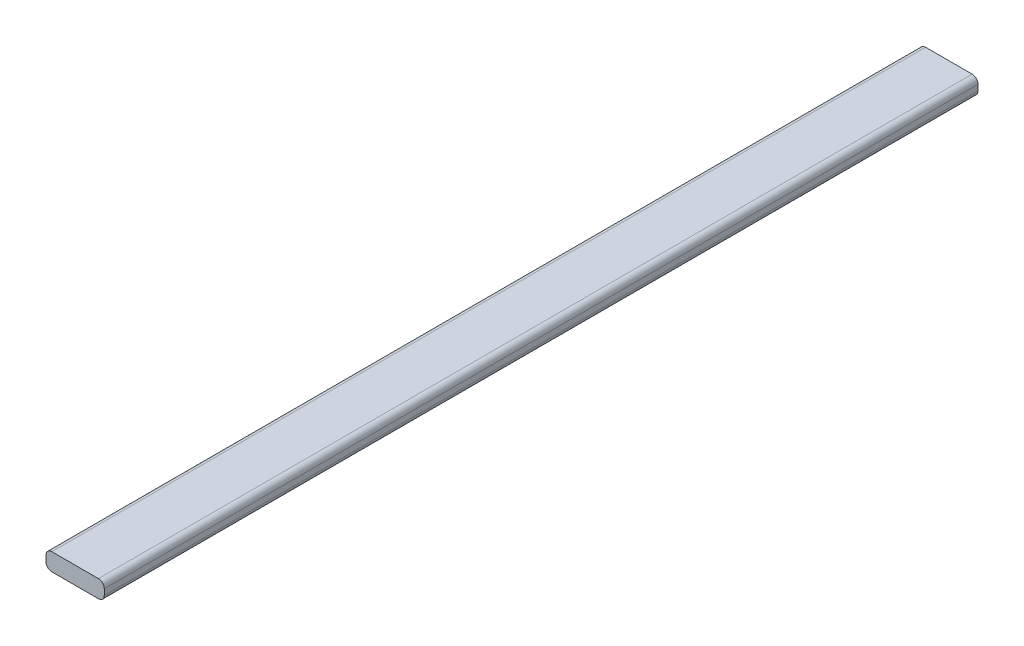
ISO-10303-21;
HEADER;
FILE_DESCRIPTION(('STEP AP214'),'2;1');
FILE_NAME('part.step','',(''),(''),'','','');
FILE_SCHEMA(('AUTOMOTIVE_DESIGN { 1 0 10303 214 1 1 1 1 }'));
ENDSEC;
DATA;
#1=APPLICATION_CONTEXT('core data for automotive mechanical design processes');
#2=APPLICATION_PROTOCOL_DEFINITION('international standard','automotive_design',2000,#1);
#3=PRODUCT_CONTEXT('',#1,'mechanical');
#4=PRODUCT('Part','Part','',(#3));
#5=PRODUCT_RELATED_PRODUCT_CATEGORY('part','',(#4));
#6=PRODUCT_DEFINITION_FORMATION('','',#4);
#7=PRODUCT_DEFINITION_CONTEXT('part definition',#1,'design');
#8=PRODUCT_DEFINITION('design','',#6,#7);
#9=PRODUCT_DEFINITION_SHAPE('','',#8);
#10=(LENGTH_UNIT() NAMED_UNIT(*) SI_UNIT(.MILLI.,.METRE.));
#11=(NAMED_UNIT(*) PLANE_ANGLE_UNIT() SI_UNIT($,.RADIAN.));
#12=(NAMED_UNIT(*) SI_UNIT($,.STERADIAN.) SOLID_ANGLE_UNIT());
#13=UNCERTAINTY_MEASURE_WITH_UNIT(LENGTH_MEASURE(1.E-05),#10,'distance_accuracy_value','');
#14=(GEOMETRIC_REPRESENTATION_CONTEXT(3) GLOBAL_UNCERTAINTY_ASSIGNED_CONTEXT((#13)) GLOBAL_UNIT_ASSIGNED_CONTEXT((#10,
#11,#12)) REPRESENTATION_CONTEXT('',''));
#15=CARTESIAN_POINT('',(0.,0.,0.));
#16=DIRECTION('',(0.,0.,1.));
#17=DIRECTION('',(1.,0.,0.));
#18=AXIS2_PLACEMENT_3D('',#15,#16,#17);
#19=CARTESIAN_POINT('',(4.,0.5,150.));
#20=DIRECTION('',(0.,0.,-1.));
#21=DIRECTION('',(-1.,0.,0.));
#22=AXIS2_PLACEMENT_3D('',#19,#20,#21);
#23=CYLINDRICAL_SURFACE('',#22,1.);
#24=CARTESIAN_POINT('',(4.,0.5,0.));
#25=DIRECTION('',(0.,0.,1.));
#26=DIRECTION('',(-1.,0.,0.));
#27=AXIS2_PLACEMENT_3D('',#24,#25,#26);
#28=CIRCLE('',#27,1.);
#29=CARTESIAN_POINT('',(5.,0.5,0.));
#30=VERTEX_POINT('',#29);
#31=CARTESIAN_POINT('',(4.,1.5,0.));
#32=VERTEX_POINT('',#31);
#33=EDGE_CURVE('E129',#30,#32,#28,.T.);
#34=ORIENTED_EDGE('',*,*,#33,.T.);
#35=DIRECTION('',(0.,0.,-1.));
#36=VECTOR('',#35,1.);
#37=CARTESIAN_POINT('',(4.,1.5,150.));
#38=LINE('',#37,#36);
#39=CARTESIAN_POINT('',(4.,1.5,150.));
#40=VERTEX_POINT('',#39);
#41=EDGE_CURVE('E11',#40,#32,#38,.T.);
#42=ORIENTED_EDGE('',*,*,#41,.F.);
#43=CARTESIAN_POINT('',(4.,0.5,150.));
#44=DIRECTION('',(0.,0.,1.));
#45=DIRECTION('',(-1.,0.,0.));
#46=AXIS2_PLACEMENT_3D('',#43,#44,#45);
#47=CIRCLE('',#46,1.);
#48=CARTESIAN_POINT('',(5.,0.5,150.));
#49=VERTEX_POINT('',#48);
#50=EDGE_CURVE('E143',#49,#40,#47,.T.);
#51=ORIENTED_EDGE('',*,*,#50,.F.);
#52=DIRECTION('',(0.,0.,-1.));
#53=VECTOR('',#52,1.);
#54=CARTESIAN_POINT('',(5.,0.5,150.));
#55=LINE('',#54,#53);
#56=EDGE_CURVE('E125',#49,#30,#55,.T.);
#57=ORIENTED_EDGE('',*,*,#56,.T.);
#58=EDGE_LOOP('',(#34,#42,#51,#57));
#59=FACE_BOUND('',#58,.T.);
#60=ADVANCED_FACE('F33',(#59),#23,.T.);
#61=CARTESIAN_POINT('',(-4.,1.5,150.));
#62=DIRECTION('',(0.,-1.,0.));
#63=DIRECTION('',(0.,0.,-1.));
#64=AXIS2_PLACEMENT_3D('',#61,#62,#63);
#65=PLANE('',#64);
#66=DIRECTION('',(-1.,0.,0.));
#67=VECTOR('',#66,1.);
#68=CARTESIAN_POINT('',(-4.,1.5,0.));
#69=LINE('',#68,#67);
#70=CARTESIAN_POINT('',(-4.,1.5,0.));
#71=VERTEX_POINT('',#70);
#72=EDGE_CURVE('E132',#32,#71,#69,.T.);
#73=ORIENTED_EDGE('',*,*,#72,.T.);
#74=DIRECTION('',(0.,0.,-1.));
#75=VECTOR('',#74,1.);
#76=CARTESIAN_POINT('',(-4.,1.5,150.));
#77=LINE('',#76,#75);
#78=CARTESIAN_POINT('',(-4.,1.5,150.));
#79=VERTEX_POINT('',#78);
#80=EDGE_CURVE('E41',#79,#71,#77,.T.);
#81=ORIENTED_EDGE('',*,*,#80,.F.);
#82=DIRECTION('',(-1.,0.,0.));
#83=VECTOR('',#82,1.);
#84=CARTESIAN_POINT('',(-4.,1.5,150.));
#85=LINE('',#84,#83);
#86=EDGE_CURVE('E92',#40,#79,#85,.T.);
#87=ORIENTED_EDGE('',*,*,#86,.F.);
#88=ORIENTED_EDGE('',*,*,#41,.T.);
#89=EDGE_LOOP('',(#73,#81,#87,#88));
#90=FACE_BOUND('',#89,.T.);
#91=ADVANCED_FACE('F178',(#90),#65,.F.);
#92=CARTESIAN_POINT('',(-4.,0.5,150.));
#93=DIRECTION('',(0.,0.,-1.));
#94=DIRECTION('',(-1.,0.,0.));
#95=AXIS2_PLACEMENT_3D('',#92,#93,#94);
#96=CYLINDRICAL_SURFACE('',#95,1.);
#97=CARTESIAN_POINT('',(-4.,0.5,0.));
#98=DIRECTION('',(0.,0.,1.));
#99=DIRECTION('',(1.,0.,0.));
#100=AXIS2_PLACEMENT_3D('',#97,#98,#99);
#101=CIRCLE('',#100,1.);
#102=CARTESIAN_POINT('',(-5.,0.5,0.));
#103=VERTEX_POINT('',#102);
#104=EDGE_CURVE('E134',#71,#103,#101,.T.);
#105=ORIENTED_EDGE('',*,*,#104,.T.);
#106=DIRECTION('',(0.,0.,-1.));
#107=VECTOR('',#106,1.);
#108=CARTESIAN_POINT('',(-5.,0.5,150.));
#109=LINE('',#108,#107);
#110=CARTESIAN_POINT('',(-5.,0.5,150.));
#111=VERTEX_POINT('',#110);
#112=EDGE_CURVE('E150',#111,#103,#109,.T.);
#113=ORIENTED_EDGE('',*,*,#112,.F.);
#114=CARTESIAN_POINT('',(-4.,0.5,150.));
#115=DIRECTION('',(0.,0.,1.));
#116=DIRECTION('',(1.,0.,0.));
#117=AXIS2_PLACEMENT_3D('',#114,#115,#116);
#118=CIRCLE('',#117,1.);
#119=EDGE_CURVE('E158',#79,#111,#118,.T.);
#120=ORIENTED_EDGE('',*,*,#119,.F.);
#121=ORIENTED_EDGE('',*,*,#80,.T.);
#122=EDGE_LOOP('',(#105,#113,#120,#121));
#123=FACE_BOUND('',#122,.T.);
#124=ADVANCED_FACE('F156',(#123),#96,.T.);
#125=CARTESIAN_POINT('',(-5.,0.5,150.));
#126=DIRECTION('',(1.,0.,0.));
#127=DIRECTION('',(0.,0.,-1.));
#128=AXIS2_PLACEMENT_3D('',#125,#126,#127);
#129=PLANE('',#128);
#130=DIRECTION('',(0.,-1.,0.));
#131=VECTOR('',#130,1.);
#132=CARTESIAN_POINT('',(-5.,0.5,0.));
#133=LINE('',#132,#131);
#134=CARTESIAN_POINT('',(-5.,-0.5,0.));
#135=VERTEX_POINT('',#134);
#136=EDGE_CURVE('E136',#103,#135,#133,.T.);
#137=ORIENTED_EDGE('',*,*,#136,.T.);
#138=DIRECTION('',(0.,0.,-1.));
#139=VECTOR('',#138,1.);
#140=CARTESIAN_POINT('',(-5.,-0.5,150.));
#141=LINE('',#140,#139);
#142=CARTESIAN_POINT('',(-5.,-0.5,150.));
#143=VERTEX_POINT('',#142);
#144=EDGE_CURVE('E147',#143,#135,#141,.T.);
#145=ORIENTED_EDGE('',*,*,#144,.F.);
#146=DIRECTION('',(0.,-1.,0.));
#147=VECTOR('',#146,1.);
#148=CARTESIAN_POINT('',(-5.,0.5,150.));
#149=LINE('',#148,#147);
#150=EDGE_CURVE('E170',#111,#143,#149,.T.);
#151=ORIENTED_EDGE('',*,*,#150,.F.);
#152=ORIENTED_EDGE('',*,*,#112,.T.);
#153=EDGE_LOOP('',(#137,#145,#151,#152));
#154=FACE_BOUND('',#153,.T.);
#155=ADVANCED_FACE('F166',(#154),#129,.F.);
#156=CARTESIAN_POINT('',(-4.,-0.5,150.));
#157=DIRECTION('',(0.,0.,-1.));
#158=DIRECTION('',(-1.,0.,0.));
#159=AXIS2_PLACEMENT_3D('',#156,#157,#158);
#160=CYLINDRICAL_SURFACE('',#159,1.);
#161=CARTESIAN_POINT('',(-4.,-0.5,0.));
#162=DIRECTION('',(0.,0.,1.));
#163=DIRECTION('',(1.,0.,0.));
#164=AXIS2_PLACEMENT_3D('',#161,#162,#163);
#165=CIRCLE('',#164,1.);
#166=CARTESIAN_POINT('',(-4.,-1.5,0.));
#167=VERTEX_POINT('',#166);
#168=EDGE_CURVE('E138',#135,#167,#165,.T.);
#169=ORIENTED_EDGE('',*,*,#168,.T.);
#170=DIRECTION('',(0.,0.,-1.));
#171=VECTOR('',#170,1.);
#172=CARTESIAN_POINT('',(-4.,-1.5,150.));
#173=LINE('',#172,#171);
#174=CARTESIAN_POINT('',(-4.,-1.5,150.));
#175=VERTEX_POINT('',#174);
#176=EDGE_CURVE('E120',#175,#167,#173,.T.);
#177=ORIENTED_EDGE('',*,*,#176,.F.);
#178=CARTESIAN_POINT('',(-4.,-0.5,150.));
#179=DIRECTION('',(0.,0.,1.));
#180=DIRECTION('',(1.,0.,0.));
#181=AXIS2_PLACEMENT_3D('',#178,#179,#180);
#182=CIRCLE('',#181,1.);
#183=EDGE_CURVE('E111',#143,#175,#182,.T.);
#184=ORIENTED_EDGE('',*,*,#183,.F.);
#185=ORIENTED_EDGE('',*,*,#144,.T.);
#186=EDGE_LOOP('',(#169,#177,#184,#185));
#187=FACE_BOUND('',#186,.T.);
#188=ADVANCED_FACE('F169',(#187),#160,.T.);
#189=CARTESIAN_POINT('',(-4.,-1.5,150.));
#190=DIRECTION('',(0.,1.,0.));
#191=DIRECTION('',(0.,0.,1.));
#192=AXIS2_PLACEMENT_3D('',#189,#190,#191);
#193=PLANE('',#192);
#194=DIRECTION('',(1.,0.,0.));
#195=VECTOR('',#194,1.);
#196=CARTESIAN_POINT('',(-4.,-1.5,0.));
#197=LINE('',#196,#195);
#198=CARTESIAN_POINT('',(4.,-1.5,0.));
#199=VERTEX_POINT('',#198);
#200=EDGE_CURVE('E119',#167,#199,#197,.T.);
#201=ORIENTED_EDGE('',*,*,#200,.T.);
#202=DIRECTION('',(0.,0.,-1.));
#203=VECTOR('',#202,1.);
#204=CARTESIAN_POINT('',(4.,-1.5,150.));
#205=LINE('',#204,#203);
#206=CARTESIAN_POINT('',(4.,-1.5,150.));
#207=VERTEX_POINT('',#206);
#208=EDGE_CURVE('E116',#207,#199,#205,.T.);
#209=ORIENTED_EDGE('',*,*,#208,.F.);
#210=DIRECTION('',(1.,0.,0.));
#211=VECTOR('',#210,1.);
#212=CARTESIAN_POINT('',(-4.,-1.5,150.));
#213=LINE('',#212,#211);
#214=EDGE_CURVE('E105',#175,#207,#213,.T.);
#215=ORIENTED_EDGE('',*,*,#214,.F.);
#216=ORIENTED_EDGE('',*,*,#176,.T.);
#217=EDGE_LOOP('',(#201,#209,#215,#216));
#218=FACE_BOUND('',#217,.T.);
#219=ADVANCED_FACE('F117',(#218),#193,.F.);
#220=CARTESIAN_POINT('',(4.,-0.5,150.));
#221=DIRECTION('',(0.,0.,-1.));
#222=DIRECTION('',(-1.,0.,0.));
#223=AXIS2_PLACEMENT_3D('',#220,#221,#222);
#224=CYLINDRICAL_SURFACE('',#223,1.);
#225=CARTESIAN_POINT('',(4.,-0.5,0.));
#226=DIRECTION('',(0.,0.,1.));
#227=DIRECTION('',(1.,0.,0.));
#228=AXIS2_PLACEMENT_3D('',#225,#226,#227);
#229=CIRCLE('',#228,1.);
#230=CARTESIAN_POINT('',(5.,-0.5,0.));
#231=VERTEX_POINT('',#230);
#232=EDGE_CURVE('E78',#199,#231,#229,.T.);
#233=ORIENTED_EDGE('',*,*,#232,.T.);
#234=DIRECTION('',(0.,0.,-1.));
#235=VECTOR('',#234,1.);
#236=CARTESIAN_POINT('',(5.,-0.5,150.));
#237=LINE('',#236,#235);
#238=CARTESIAN_POINT('',(5.,-0.5,150.));
#239=VERTEX_POINT('',#238);
#240=EDGE_CURVE('E121',#239,#231,#237,.T.);
#241=ORIENTED_EDGE('',*,*,#240,.F.);
#242=CARTESIAN_POINT('',(4.,-0.5,150.));
#243=DIRECTION('',(0.,0.,1.));
#244=DIRECTION('',(1.,0.,0.));
#245=AXIS2_PLACEMENT_3D('',#242,#243,#244);
#246=CIRCLE('',#245,1.);
#247=EDGE_CURVE('E109',#207,#239,#246,.T.);
#248=ORIENTED_EDGE('',*,*,#247,.F.);
#249=ORIENTED_EDGE('',*,*,#208,.T.);
#250=EDGE_LOOP('',(#233,#241,#248,#249));
#251=FACE_BOUND('',#250,.T.);
#252=ADVANCED_FACE('F123',(#251),#224,.T.);
#253=CARTESIAN_POINT('',(5.,0.5,150.));
#254=DIRECTION('',(-1.,0.,0.));
#255=DIRECTION('',(0.,0.,1.));
#256=AXIS2_PLACEMENT_3D('',#253,#254,#255);
#257=PLANE('',#256);
#258=DIRECTION('',(0.,1.,0.));
#259=VECTOR('',#258,1.);
#260=CARTESIAN_POINT('',(5.,0.5,0.));
#261=LINE('',#260,#259);
#262=EDGE_CURVE('E84',#231,#30,#261,.T.);
#263=ORIENTED_EDGE('',*,*,#262,.T.);
#264=ORIENTED_EDGE('',*,*,#56,.F.);
#265=DIRECTION('',(0.,1.,0.));
#266=VECTOR('',#265,1.);
#267=CARTESIAN_POINT('',(5.,0.5,150.));
#268=LINE('',#267,#266);
#269=EDGE_CURVE('E49',#239,#49,#268,.T.);
#270=ORIENTED_EDGE('',*,*,#269,.F.);
#271=ORIENTED_EDGE('',*,*,#240,.T.);
#272=EDGE_LOOP('',(#263,#264,#270,#271));
#273=FACE_BOUND('',#272,.T.);
#274=ADVANCED_FACE('F194',(#273),#257,.F.);
#275=CARTESIAN_POINT('',(4.,0.5,150.));
#276=DIRECTION('',(0.,0.,-1.));
#277=DIRECTION('',(-1.,0.,0.));
#278=AXIS2_PLACEMENT_3D('',#275,#276,#277);
#279=PLANE('',#278);
#280=ORIENTED_EDGE('',*,*,#50,.T.);
#281=ORIENTED_EDGE('',*,*,#86,.T.);
#282=ORIENTED_EDGE('',*,*,#119,.T.);
#283=ORIENTED_EDGE('',*,*,#150,.T.);
#284=ORIENTED_EDGE('',*,*,#183,.T.);
#285=ORIENTED_EDGE('',*,*,#214,.T.);
#286=ORIENTED_EDGE('',*,*,#247,.T.);
#287=ORIENTED_EDGE('',*,*,#269,.T.);
#288=EDGE_LOOP('',(#280,#281,#282,#283,#284,#285,#286,#287));
#289=FACE_BOUND('',#288,.T.);
#290=ADVANCED_FACE('F107',(#289),#279,.F.);
#291=CARTESIAN_POINT('',(4.,0.5,0.));
#292=DIRECTION('',(0.,0.,-1.));
#293=DIRECTION('',(-1.,0.,0.));
#294=AXIS2_PLACEMENT_3D('',#291,#292,#293);
#295=PLANE('',#294);
#296=ORIENTED_EDGE('',*,*,#33,.F.);
#297=ORIENTED_EDGE('',*,*,#262,.F.);
#298=ORIENTED_EDGE('',*,*,#232,.F.);
#299=ORIENTED_EDGE('',*,*,#200,.F.);
#300=ORIENTED_EDGE('',*,*,#168,.F.);
#301=ORIENTED_EDGE('',*,*,#136,.F.);
#302=ORIENTED_EDGE('',*,*,#104,.F.);
#303=ORIENTED_EDGE('',*,*,#72,.F.);
#304=EDGE_LOOP('',(#296,#297,#298,#299,#300,#301,#302,#303));
#305=FACE_BOUND('',#304,.T.);
#306=ADVANCED_FACE('F162',(#305),#295,.T.);
#307=CLOSED_SHELL('',(#60,#91,#124,#155,#188,#219,#252,#274,#290,#306));
#308=MANIFOLD_SOLID_BREP('B2',#307);
#309=ADVANCED_BREP_SHAPE_REPRESENTATION('',(#18,#308),#14);
#310=SHAPE_DEFINITION_REPRESENTATION(#9,#309);
ENDSEC;
END-ISO-10303-21;
